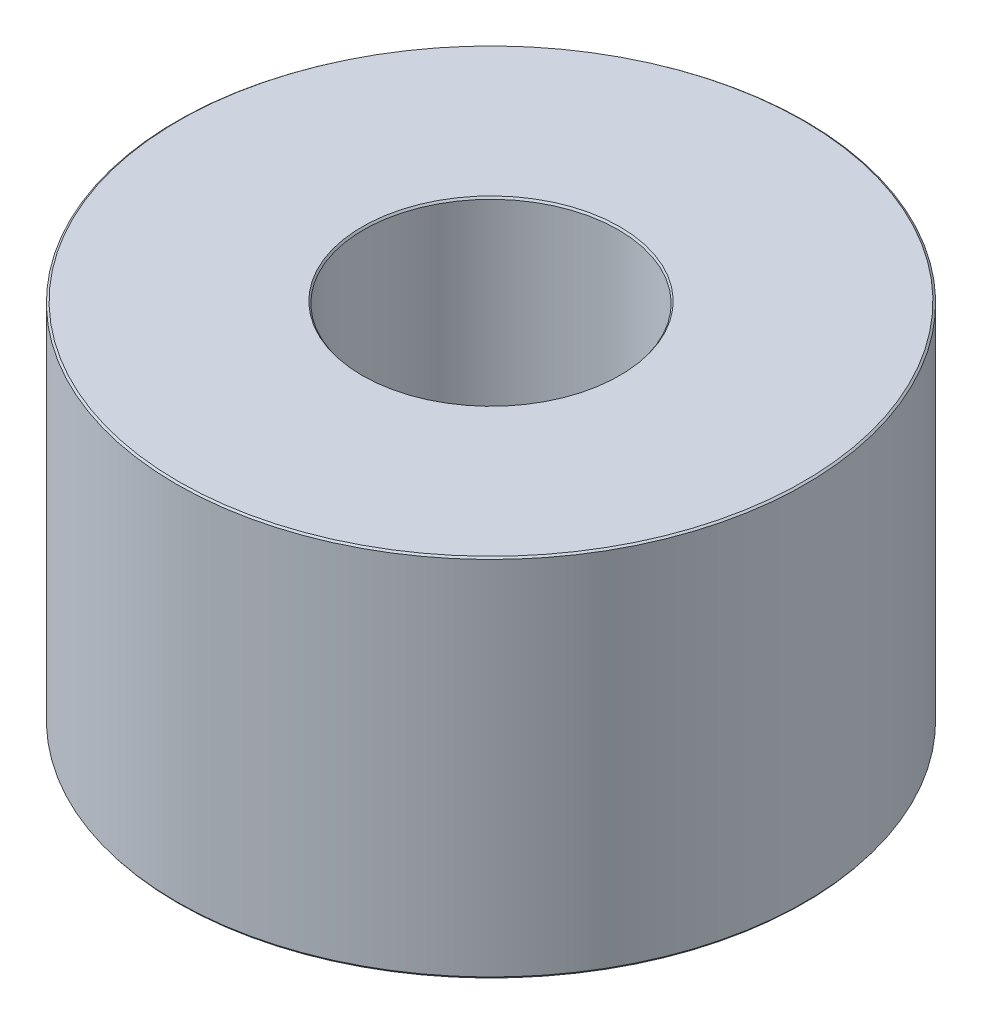
ISO-10303-21;
HEADER;
FILE_DESCRIPTION(('STEP AP214'),'2;1');
FILE_NAME('part.step','',(''),(''),'','','');
FILE_SCHEMA(('AUTOMOTIVE_DESIGN { 1 0 10303 214 1 1 1 1 }'));
ENDSEC;
DATA;
#1=APPLICATION_CONTEXT('core data for automotive mechanical design processes');
#2=APPLICATION_PROTOCOL_DEFINITION('international standard','automotive_design',2000,#1);
#3=PRODUCT_CONTEXT('',#1,'mechanical');
#4=PRODUCT('Part','Part','',(#3));
#5=PRODUCT_RELATED_PRODUCT_CATEGORY('part','',(#4));
#6=PRODUCT_DEFINITION_FORMATION('','',#4);
#7=PRODUCT_DEFINITION_CONTEXT('part definition',#1,'design');
#8=PRODUCT_DEFINITION('design','',#6,#7);
#9=PRODUCT_DEFINITION_SHAPE('','',#8);
#10=(LENGTH_UNIT() NAMED_UNIT(*) SI_UNIT(.MILLI.,.METRE.));
#11=(NAMED_UNIT(*) PLANE_ANGLE_UNIT() SI_UNIT($,.RADIAN.));
#12=(NAMED_UNIT(*) SI_UNIT($,.STERADIAN.) SOLID_ANGLE_UNIT());
#13=UNCERTAINTY_MEASURE_WITH_UNIT(LENGTH_MEASURE(1.E-05),#10,'distance_accuracy_value','');
#14=(GEOMETRIC_REPRESENTATION_CONTEXT(3) GLOBAL_UNCERTAINTY_ASSIGNED_CONTEXT((#13)) GLOBAL_UNIT_ASSIGNED_CONTEXT((#10,
#11,#12)) REPRESENTATION_CONTEXT('',''));
#15=CARTESIAN_POINT('',(0.,0.,0.));
#16=DIRECTION('',(0.,0.,1.));
#17=DIRECTION('',(1.,0.,0.));
#18=AXIS2_PLACEMENT_3D('',#15,#16,#17);
#19=CARTESIAN_POINT('',(0.,55.1286280386647,0.));
#20=DIRECTION('',(0.,-1.,0.));
#21=DIRECTION('',(0.,0.,-1.));
#22=AXIS2_PLACEMENT_3D('',#19,#20,#21);
#23=CYLINDRICAL_SURFACE('',#22,47.5);
#24=CARTESIAN_POINT('',(0.,0.288203317644273,0.));
#25=DIRECTION('',(0.,1.,0.));
#26=DIRECTION('',(0.,0.,1.));
#27=AXIS2_PLACEMENT_3D('',#24,#25,#26);
#28=CIRCLE('',#27,47.5);
#29=CARTESIAN_POINT('',(0.,0.288203317644273,47.5));
#30=VERTEX_POINT('',#29);
#31=EDGE_CURVE('E10',#30,#30,#28,.T.);
#32=ORIENTED_EDGE('',*,*,#31,.T.);
#33=EDGE_LOOP('',(#32));
#34=FACE_BOUND('',#33,.T.);
#35=CARTESIAN_POINT('',(0.,54.9132741521205,0.));
#36=DIRECTION('',(0.,1.,0.));
#37=DIRECTION('',(0.,0.,1.));
#38=AXIS2_PLACEMENT_3D('',#35,#36,#37);
#39=CIRCLE('',#38,47.5);
#40=CARTESIAN_POINT('',(0.,54.9132741521205,47.5));
#41=VERTEX_POINT('',#40);
#42=EDGE_CURVE('E50',#41,#41,#39,.F.);
#43=ORIENTED_EDGE('',*,*,#42,.T.);
#44=EDGE_LOOP('',(#43));
#45=FACE_BOUND('',#44,.T.);
#46=ADVANCED_FACE('F39',(#34,#45),#23,.T.);
#47=CARTESIAN_POINT('',(0.,55.1286280386647,0.));
#48=DIRECTION('',(0.,1.,0.));
#49=DIRECTION('',(0.,0.,1.));
#50=AXIS2_PLACEMENT_3D('',#47,#48,#49);
#51=PLANE('',#50);
#52=CARTESIAN_POINT('',(0.,55.1286280386647,0.));
#53=DIRECTION('',(0.,1.,0.));
#54=DIRECTION('',(0.,0.,1.));
#55=AXIS2_PLACEMENT_3D('',#52,#53,#54);
#56=CIRCLE('',#55,19.4658639145653);
#57=CARTESIAN_POINT('',(0.,55.1286280386647,19.4658639145653));
#58=VERTEX_POINT('',#57);
#59=EDGE_CURVE('E58',#58,#58,#56,.F.);
#60=ORIENTED_EDGE('',*,*,#59,.T.);
#61=EDGE_LOOP('',(#60));
#62=FACE_BOUND('',#61,.T.);
#63=CARTESIAN_POINT('',(0.,55.1286280386647,0.));
#64=DIRECTION('',(0.,1.,0.));
#65=DIRECTION('',(0.,0.,1.));
#66=AXIS2_PLACEMENT_3D('',#63,#64,#65);
#67=CIRCLE('',#66,47.2117966823558);
#68=CARTESIAN_POINT('',(0.,55.1286280386647,47.2117966823558));
#69=VERTEX_POINT('',#68);
#70=EDGE_CURVE('E61',#69,#69,#67,.T.);
#71=ORIENTED_EDGE('',*,*,#70,.T.);
#72=EDGE_LOOP('',(#71));
#73=FACE_BOUND('',#72,.T.);
#74=ADVANCED_FACE('F88',(#62,#73),#51,.T.);
#75=CARTESIAN_POINT('',(0.,0.,0.));
#76=DIRECTION('',(0.,1.,0.));
#77=DIRECTION('',(0.,0.,1.));
#78=AXIS2_PLACEMENT_3D('',#75,#76,#77);
#79=PLANE('',#78);
#80=CARTESIAN_POINT('',(0.,0.,0.));
#81=DIRECTION('',(0.,1.,0.));
#82=DIRECTION('',(0.,0.,1.));
#83=AXIS2_PLACEMENT_3D('',#80,#81,#82);
#84=CIRCLE('',#83,19.5387133456654);
#85=CARTESIAN_POINT('',(0.,0.,19.5387133456654));
#86=VERTEX_POINT('',#85);
#87=EDGE_CURVE('E51',#86,#86,#84,.T.);
#88=ORIENTED_EDGE('',*,*,#87,.T.);
#89=EDGE_LOOP('',(#88));
#90=FACE_BOUND('',#89,.T.);
#91=CARTESIAN_POINT('',(0.,0.,0.));
#92=DIRECTION('',(0.,1.,0.));
#93=DIRECTION('',(0.,0.,1.));
#94=AXIS2_PLACEMENT_3D('',#91,#92,#93);
#95=CIRCLE('',#94,47.2846461134559);
#96=CARTESIAN_POINT('',(0.,0.,47.2846461134559));
#97=VERTEX_POINT('',#96);
#98=EDGE_CURVE('E54',#97,#97,#95,.F.);
#99=ORIENTED_EDGE('',*,*,#98,.T.);
#100=EDGE_LOOP('',(#99));
#101=FACE_BOUND('',#100,.T.);
#102=ADVANCED_FACE('F83',(#90,#101),#79,.F.);
#103=CARTESIAN_POINT('',(0.,55.1286280386647,0.));
#104=DIRECTION('',(0.,-1.,0.));
#105=DIRECTION('',(0.,0.,-1.));
#106=AXIS2_PLACEMENT_3D('',#103,#104,#105);
#107=CYLINDRICAL_SURFACE('',#106,19.2505100280211);
#108=CARTESIAN_POINT('',(0.,54.8404247210204,0.));
#109=DIRECTION('',(0.,1.,0.));
#110=DIRECTION('',(0.,0.,1.));
#111=AXIS2_PLACEMENT_3D('',#108,#109,#110);
#112=CIRCLE('',#111,19.2505100280211);
#113=CARTESIAN_POINT('',(0.,54.8404247210204,19.2505100280211));
#114=VERTEX_POINT('',#113);
#115=EDGE_CURVE('E67',#114,#114,#112,.T.);
#116=ORIENTED_EDGE('',*,*,#115,.T.);
#117=EDGE_LOOP('',(#116));
#118=FACE_BOUND('',#117,.T.);
#119=CARTESIAN_POINT('',(0.,0.215353886544159,0.));
#120=DIRECTION('',(0.,1.,0.));
#121=DIRECTION('',(0.,0.,1.));
#122=AXIS2_PLACEMENT_3D('',#119,#120,#121);
#123=CIRCLE('',#122,19.2505100280211);
#124=CARTESIAN_POINT('',(0.,0.215353886544159,19.2505100280211));
#125=VERTEX_POINT('',#124);
#126=EDGE_CURVE('E69',#125,#125,#123,.F.);
#127=ORIENTED_EDGE('',*,*,#126,.T.);
#128=EDGE_LOOP('',(#127));
#129=FACE_BOUND('',#128,.T.);
#130=ADVANCED_FACE('F71',(#118,#129),#107,.F.);
#131=CARTESIAN_POINT('',(0.,54.8404247210204,0.));
#132=DIRECTION('',(0.,1.,0.));
#133=DIRECTION('',(0.,0.,1.));
#134=AXIS2_PLACEMENT_3D('',#131,#132,#133);
#135=CONICAL_SURFACE('',#134,19.2505100280211,0.641725330308219);
#136=CARTESIAN_POINT('',(0.,55.1286280386647,19.4658639145653));
#137=CARTESIAN_POINT('',(0.,55.1256259207725,19.4636206449138));
#138=CARTESIAN_POINT('',(0.,55.1226238028804,19.4613773752623));
#139=CARTESIAN_POINT('',(0.,55.1166195670962,19.4568908359593));
#140=CARTESIAN_POINT('',(0.,55.113617449204,19.4546475663078));
#141=CARTESIAN_POINT('',(0.,55.1076132134198,19.4501610270048));
#142=CARTESIAN_POINT('',(0.,55.1046110955276,19.4479177573533));
#143=CARTESIAN_POINT('',(0.,55.0986068597434,19.4434312180503));
#144=CARTESIAN_POINT('',(0.,55.0956047418513,19.4411879483988));
#145=CARTESIAN_POINT('',(0.,55.089600506067,19.4367014090958));
#146=CARTESIAN_POINT('',(0.,55.0865983881749,19.4344581394443));
#147=CARTESIAN_POINT('',(0.,55.0805941523906,19.4299716001413));
#148=CARTESIAN_POINT('',(0.,55.0775920344985,19.4277283304898));
#149=CARTESIAN_POINT('',(0.,55.0715877987142,19.4232417911868));
#150=CARTESIAN_POINT('',(0.,55.0685856808221,19.4209985215353));
#151=CARTESIAN_POINT('',(0.,55.0625814450378,19.4165119822323));
#152=CARTESIAN_POINT('',(0.,55.0595793271457,19.4142687125807));
#153=CARTESIAN_POINT('',(0.,55.0535750913615,19.4097821732777));
#154=CARTESIAN_POINT('',(0.,55.0505729734693,19.4075389036262));
#155=CARTESIAN_POINT('',(0.,55.0445687376851,19.4030523643232));
#156=CARTESIAN_POINT('',(0.,55.041566619793,19.4008090946717));
#157=CARTESIAN_POINT('',(0.,55.0355623840087,19.3963225553687));
#158=CARTESIAN_POINT('',(0.,55.0325602661166,19.3940792857172));
#159=CARTESIAN_POINT('',(0.,55.0265560303323,19.3895927464142));
#160=CARTESIAN_POINT('',(0.,55.0235539124402,19.3873494767627));
#161=CARTESIAN_POINT('',(0.,55.0175496766559,19.3828629374597));
#162=CARTESIAN_POINT('',(0.,55.0145475587638,19.3806196678082));
#163=CARTESIAN_POINT('',(0.,55.0085433229795,19.3761331285052));
#164=CARTESIAN_POINT('',(0.,55.0055412050874,19.3738898588537));
#165=CARTESIAN_POINT('',(0.,54.9995369693032,19.3694033195507));
#166=CARTESIAN_POINT('',(0.,54.996534851411,19.3671600498992));
#167=CARTESIAN_POINT('',(0.,54.9905306156268,19.3626735105962));
#168=CARTESIAN_POINT('',(0.,54.9875284977346,19.3604302409447));
#169=CARTESIAN_POINT('',(0.,54.9815242619504,19.3559437016417));
#170=CARTESIAN_POINT('',(0.,54.9785221440583,19.3537004319902));
#171=CARTESIAN_POINT('',(0.,54.972517908274,19.3492138926872));
#172=CARTESIAN_POINT('',(0.,54.9695157903819,19.3469706230357));
#173=CARTESIAN_POINT('',(0.,54.9635115545976,19.3424840837327));
#174=CARTESIAN_POINT('',(0.,54.9605094367055,19.3402408140812));
#175=CARTESIAN_POINT('',(0.,54.9545052009212,19.3357542747782));
#176=CARTESIAN_POINT('',(0.,54.9515030830291,19.3335110051267));
#177=CARTESIAN_POINT('',(0.,54.9454988472449,19.3290244658237));
#178=CARTESIAN_POINT('',(0.,54.9424967293527,19.3267811961722));
#179=CARTESIAN_POINT('',(0.,54.9364924935685,19.3222946568692));
#180=CARTESIAN_POINT('',(0.,54.9334903756763,19.3200513872177));
#181=CARTESIAN_POINT('',(0.,54.9274861398921,19.3155648479147));
#182=CARTESIAN_POINT('',(0.,54.924484022,19.3133215782632));
#183=CARTESIAN_POINT('',(0.,54.9184797862157,19.3088350389602));
#184=CARTESIAN_POINT('',(0.,54.9154776683236,19.3065917693087));
#185=CARTESIAN_POINT('',(0.,54.9094734325393,19.3021052300057));
#186=CARTESIAN_POINT('',(0.,54.9064713146472,19.2998619603542));
#187=CARTESIAN_POINT('',(0.,54.9004670788629,19.2953754210512));
#188=CARTESIAN_POINT('',(0.,54.8974649609708,19.2931321513996));
#189=CARTESIAN_POINT('',(0.,54.8914607251866,19.2886456120966));
#190=CARTESIAN_POINT('',(0.,54.8884586072944,19.2864023424451));
#191=CARTESIAN_POINT('',(0.,54.8824543715102,19.2819158031421));
#192=CARTESIAN_POINT('',(0.,54.879452253618,19.2796725334906));
#193=CARTESIAN_POINT('',(0.,54.8734480178338,19.2751859941876));
#194=CARTESIAN_POINT('',(0.,54.8704458999417,19.2729427245361));
#195=CARTESIAN_POINT('',(0.,54.8644416641574,19.2684561852331));
#196=CARTESIAN_POINT('',(0.,54.8614395462653,19.2662129155816));
#197=CARTESIAN_POINT('',(0.,54.855435310481,19.2617263762786));
#198=CARTESIAN_POINT('',(0.,54.8524331925889,19.2594831066271));
#199=CARTESIAN_POINT('',(0.,54.8464289568046,19.2549965673241));
#200=CARTESIAN_POINT('',(0.,54.8434268389125,19.2527532976726));
#201=CARTESIAN_POINT('',(0.,54.8404247210204,19.2505100280211));
#202=B_SPLINE_CURVE_WITH_KNOTS('',3,(#136,#137,#138,#139,#140,#141,#142,#143,#144,#145,#146,
#147,#148,#149,#150,#151,#152,#153,#154,#155,#156,#157,#158,#159,#160,#161,#162,#163,#164,#165,
#166,#167,#168,#169,#170,#171,#172,#173,#174,#175,#176,#177,#178,#179,#180,#181,#182,#183,#184,
#185,#186,#187,#188,#189,#190,#191,#192,#193,#194,#195,#196,#197,#198,#199,#200,#201),
.UNSPECIFIED.,.F.,.F.,(4,2,2,2,2,2,2,2,2,2,2,2,2,2,2,2,2,2,2,2,2,2,2,2,2,2,2,2,2,2,2,2,4),(0.,
0.0112429860405566,0.0224859720811188,0.033728958121683,0.0449719441622451,0.0562149302028017,
0.067457916243366,0.0787009022839281,0.0899438883244924,0.101186874365049,0.112429860405611,
0.123672846446175,0.134915832486737,0.146158818527294,0.157401804567858,0.16864479060842,
0.179887776648983,0.191130762689541,0.202373748730103,0.213616734770666,0.22485972081123,
0.236102706851786,0.247345692892349,0.258588678932913,0.269831664973475,0.281074651014032,
0.292317637054596,0.303560623095158,0.31480360913572,0.326046595176279,0.337289581216841,
0.348532567257403,0.359775553297962),.UNSPECIFIED.);
#203=EDGE_CURVE('BSEAM77',#58,#114,#202,.T.);
#204=ORIENTED_EDGE('',*,*,#59,.F.);
#205=ORIENTED_EDGE('',*,*,#115,.F.);
#206=ORIENTED_EDGE('',*,*,#203,.T.);
#207=ORIENTED_EDGE('',*,*,#203,.F.);
#208=EDGE_LOOP('',(#204,#206,#205,#207));
#209=FACE_BOUND('',#208,.T.);
#210=ADVANCED_FACE('F77',(#209),#135,.F.);
#211=CARTESIAN_POINT('',(0.,0.,0.));
#212=DIRECTION('',(0.,-1.,0.));
#213=DIRECTION('',(0.,0.,-1.));
#214=AXIS2_PLACEMENT_3D('',#211,#212,#213);
#215=CONICAL_SURFACE('',#214,19.5387133456654,0.929070996486703);
#216=ORIENTED_EDGE('',*,*,#126,.F.);
#217=EDGE_LOOP('',(#216));
#218=FACE_BOUND('',#217,.T.);
#219=ORIENTED_EDGE('',*,*,#87,.F.);
#220=EDGE_LOOP('',(#219));
#221=FACE_BOUND('',#220,.T.);
#222=ADVANCED_FACE('F73',(#218,#221),#215,.F.);
#223=CARTESIAN_POINT('',(0.,0.288203317644273,0.));
#224=DIRECTION('',(0.,1.,0.));
#225=DIRECTION('',(0.,0.,1.));
#226=AXIS2_PLACEMENT_3D('',#223,#224,#225);
#227=CONICAL_SURFACE('',#226,47.5,0.641725330308172);
#228=ORIENTED_EDGE('',*,*,#98,.F.);
#229=EDGE_LOOP('',(#228));
#230=FACE_BOUND('',#229,.T.);
#231=ORIENTED_EDGE('',*,*,#31,.F.);
#232=EDGE_LOOP('',(#231));
#233=FACE_BOUND('',#232,.T.);
#234=ADVANCED_FACE('F76',(#230,#233),#227,.T.);
#235=CARTESIAN_POINT('',(0.,55.1286280386647,0.));
#236=DIRECTION('',(0.,-1.,0.));
#237=DIRECTION('',(0.,0.,-1.));
#238=AXIS2_PLACEMENT_3D('',#235,#236,#237);
#239=CONICAL_SURFACE('',#238,47.2117966823558,0.929070996486751);
#240=ORIENTED_EDGE('',*,*,#42,.F.);
#241=EDGE_LOOP('',(#240));
#242=FACE_BOUND('',#241,.T.);
#243=ORIENTED_EDGE('',*,*,#70,.F.);
#244=EDGE_LOOP('',(#243));
#245=FACE_BOUND('',#244,.T.);
#246=ADVANCED_FACE('F45',(#242,#245),#239,.T.);
#247=CLOSED_SHELL('',(#46,#74,#102,#130,#210,#222,#234,#246));
#248=MANIFOLD_SOLID_BREP('B2',#247);
#249=ADVANCED_BREP_SHAPE_REPRESENTATION('',(#18,#248),#14);
#250=SHAPE_DEFINITION_REPRESENTATION(#9,#249);
ENDSEC;
END-ISO-10303-21;
